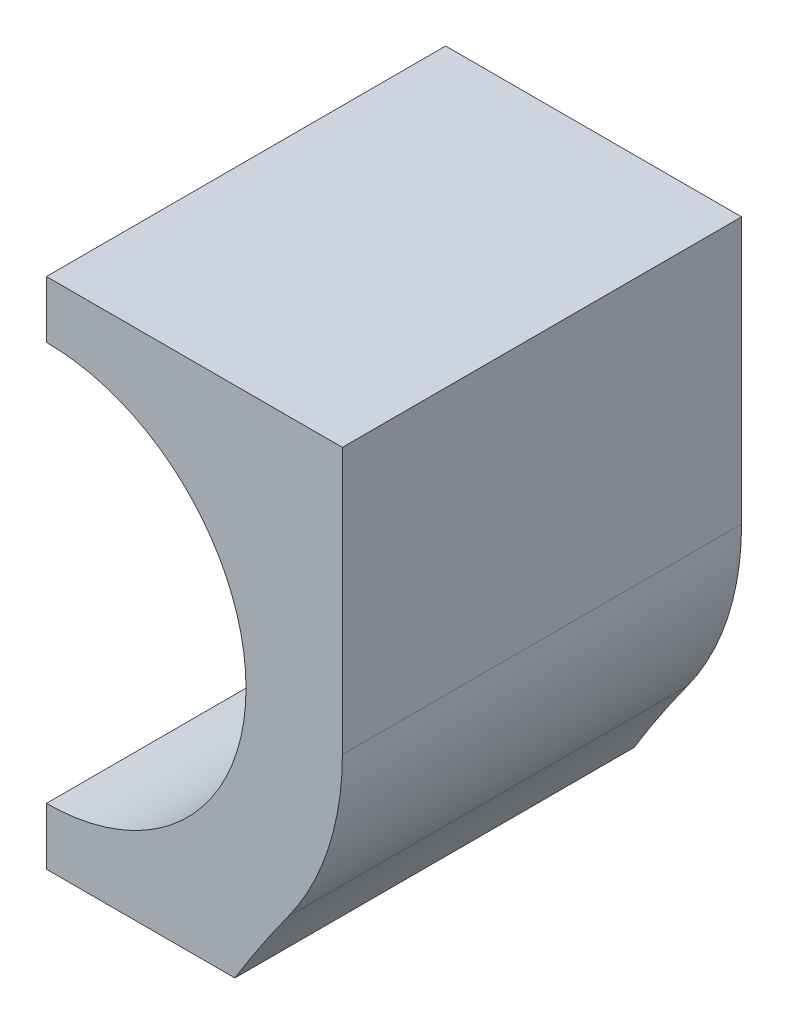
ISO-10303-21;
HEADER;
FILE_DESCRIPTION(('STEP AP214'),'2;1');
FILE_NAME('part.step','',(''),(''),'','','');
FILE_SCHEMA(('AUTOMOTIVE_DESIGN { 1 0 10303 214 1 1 1 1 }'));
ENDSEC;
DATA;
#1=APPLICATION_CONTEXT('core data for automotive mechanical design processes');
#2=APPLICATION_PROTOCOL_DEFINITION('international standard','automotive_design',2000,#1);
#3=PRODUCT_CONTEXT('',#1,'mechanical');
#4=PRODUCT('Part','Part','',(#3));
#5=PRODUCT_RELATED_PRODUCT_CATEGORY('part','',(#4));
#6=PRODUCT_DEFINITION_FORMATION('','',#4);
#7=PRODUCT_DEFINITION_CONTEXT('part definition',#1,'design');
#8=PRODUCT_DEFINITION('design','',#6,#7);
#9=PRODUCT_DEFINITION_SHAPE('','',#8);
#10=(LENGTH_UNIT() NAMED_UNIT(*) SI_UNIT(.MILLI.,.METRE.));
#11=(NAMED_UNIT(*) PLANE_ANGLE_UNIT() SI_UNIT($,.RADIAN.));
#12=(NAMED_UNIT(*) SI_UNIT($,.STERADIAN.) SOLID_ANGLE_UNIT());
#13=UNCERTAINTY_MEASURE_WITH_UNIT(LENGTH_MEASURE(1.E-05),#10,'distance_accuracy_value','');
#14=(GEOMETRIC_REPRESENTATION_CONTEXT(3) GLOBAL_UNCERTAINTY_ASSIGNED_CONTEXT((#13)) GLOBAL_UNIT_ASSIGNED_CONTEXT((#10,
#11,#12)) REPRESENTATION_CONTEXT('',''));
#15=CARTESIAN_POINT('',(0.,0.,0.));
#16=DIRECTION('',(0.,0.,1.));
#17=DIRECTION('',(1.,0.,0.));
#18=AXIS2_PLACEMENT_3D('',#15,#16,#17);
#19=CARTESIAN_POINT('',(-14.3350507415989,439.94620922742,34.7774113637381));
#20=DIRECTION('',(0.,0.,-1.));
#21=DIRECTION('',(-1.,0.,0.));
#22=AXIS2_PLACEMENT_3D('',#19,#20,#21);
#23=CYLINDRICAL_SURFACE('',#22,9.99999999999998);
#24=CARTESIAN_POINT('',(-14.3350507415989,439.94620922742,14.0000000000005));
#25=DIRECTION('',(0.,0.,1.));
#26=DIRECTION('',(0.,-1.,0.));
#27=AXIS2_PLACEMENT_3D('',#24,#25,#26);
#28=CIRCLE('',#27,9.99999999999998);
#29=CARTESIAN_POINT('',(-6.23981264636083,434.075338748402,14.0000000000004));
#30=VERTEX_POINT('',#29);
#31=CARTESIAN_POINT('',(-4.33505074159894,439.94620922742,14.0000000000006));
#32=VERTEX_POINT('',#31);
#33=EDGE_CURVE('E132',#30,#32,#28,.T.);
#34=ORIENTED_EDGE('',*,*,#33,.F.);
#35=DIRECTION('',(0.,0.,-1.));
#36=VECTOR('',#35,1.);
#37=CARTESIAN_POINT('',(-6.23981264636084,434.075338748402,34.7774113637381));
#38=LINE('',#37,#36);
#39=CARTESIAN_POINT('',(-6.23981264636084,434.075338748402,0.));
#40=VERTEX_POINT('',#39);
#41=EDGE_CURVE('E37',#30,#40,#38,.T.);
#42=ORIENTED_EDGE('',*,*,#41,.T.);
#43=CARTESIAN_POINT('',(-14.3350507415989,439.94620922742,0.));
#44=DIRECTION('',(0.,0.,1.));
#45=DIRECTION('',(1.,0.,0.));
#46=AXIS2_PLACEMENT_3D('',#43,#44,#45);
#47=CIRCLE('',#46,9.99999999999998);
#48=CARTESIAN_POINT('',(-4.33505074159894,439.94620922742,0.));
#49=VERTEX_POINT('',#48);
#50=EDGE_CURVE('E140',#40,#49,#47,.T.);
#51=ORIENTED_EDGE('',*,*,#50,.T.);
#52=DIRECTION('',(0.,0.,-1.));
#53=VECTOR('',#52,1.);
#54=CARTESIAN_POINT('',(-4.33505074159894,439.94620922742,34.7774113637381));
#55=LINE('',#54,#53);
#56=EDGE_CURVE('E88',#32,#49,#55,.T.);
#57=ORIENTED_EDGE('',*,*,#56,.F.);
#58=EDGE_LOOP('',(#34,#42,#51,#57));
#59=FACE_BOUND('',#58,.T.);
#60=ADVANCED_FACE('F33',(#59),#23,.T.);
#61=CARTESIAN_POINT('',(-4.33505074159894,439.94620922742,34.7774113637381));
#62=DIRECTION('',(-1.,0.,0.));
#63=DIRECTION('',(0.,0.,1.));
#64=AXIS2_PLACEMENT_3D('',#61,#62,#63);
#65=PLANE('',#64);
#66=DIRECTION('',(0.,1.,0.));
#67=VECTOR('',#66,1.);
#68=CARTESIAN_POINT('',(-4.33505074159894,439.94620922742,14.0000000000005));
#69=LINE('',#68,#67);
#70=CARTESIAN_POINT('',(-4.33505074159894,449.276757584087,14.0000000000006));
#71=VERTEX_POINT('',#70);
#72=EDGE_CURVE('E95',#32,#71,#69,.T.);
#73=ORIENTED_EDGE('',*,*,#72,.F.);
#74=ORIENTED_EDGE('',*,*,#56,.T.);
#75=DIRECTION('',(0.,1.,0.));
#76=VECTOR('',#75,1.);
#77=CARTESIAN_POINT('',(-4.33505074159894,439.94620922742,0.));
#78=LINE('',#77,#76);
#79=CARTESIAN_POINT('',(-4.33505074159894,449.276757584087,0.));
#80=VERTEX_POINT('',#79);
#81=EDGE_CURVE('E139',#49,#80,#78,.T.);
#82=ORIENTED_EDGE('',*,*,#81,.T.);
#83=DIRECTION('',(0.,0.,-1.));
#84=VECTOR('',#83,1.);
#85=CARTESIAN_POINT('',(-4.33505074159894,449.276757584087,34.7774113637381));
#86=LINE('',#85,#84);
#87=EDGE_CURVE('E141',#71,#80,#86,.T.);
#88=ORIENTED_EDGE('',*,*,#87,.F.);
#89=EDGE_LOOP('',(#73,#74,#82,#88));
#90=FACE_BOUND('',#89,.T.);
#91=ADVANCED_FACE('F170',(#90),#65,.F.);
#92=CARTESIAN_POINT('',(-14.7129514434736,449.276757584087,34.7774113637381));
#93=DIRECTION('',(0.,-1.,0.));
#94=DIRECTION('',(0.,0.,-1.));
#95=AXIS2_PLACEMENT_3D('',#92,#93,#94);
#96=PLANE('',#95);
#97=DIRECTION('',(-1.,0.,0.));
#98=VECTOR('',#97,1.);
#99=CARTESIAN_POINT('',(-14.7129514434736,449.276757584087,14.0000000000006));
#100=LINE('',#99,#98);
#101=CARTESIAN_POINT('',(-14.7129514434736,449.276757584087,14.0000000000006));
#102=VERTEX_POINT('',#101);
#103=EDGE_CURVE('E128',#71,#102,#100,.T.);
#104=ORIENTED_EDGE('',*,*,#103,.F.);
#105=ORIENTED_EDGE('',*,*,#87,.T.);
#106=DIRECTION('',(-1.,0.,0.));
#107=VECTOR('',#106,1.);
#108=CARTESIAN_POINT('',(-14.7129514434736,449.276757584087,0.));
#109=LINE('',#108,#107);
#110=CARTESIAN_POINT('',(-14.7129514434736,449.276757584087,0.));
#111=VERTEX_POINT('',#110);
#112=EDGE_CURVE('E143',#80,#111,#109,.T.);
#113=ORIENTED_EDGE('',*,*,#112,.T.);
#114=DIRECTION('',(0.,0.,-1.));
#115=VECTOR('',#114,1.);
#116=CARTESIAN_POINT('',(-14.7129514434736,449.276757584087,34.7774113637381));
#117=LINE('',#116,#115);
#118=EDGE_CURVE('E144',#102,#111,#117,.T.);
#119=ORIENTED_EDGE('',*,*,#118,.F.);
#120=EDGE_LOOP('',(#104,#105,#113,#119));
#121=FACE_BOUND('',#120,.T.);
#122=ADVANCED_FACE('F173',(#121),#96,.F.);
#123=CARTESIAN_POINT('',(-14.7129514434736,447.276757584087,34.7774113637381));
#124=DIRECTION('',(1.,0.,0.));
#125=DIRECTION('',(0.,0.,-1.));
#126=AXIS2_PLACEMENT_3D('',#123,#124,#125);
#127=PLANE('',#126);
#128=DIRECTION('',(0.,-1.,0.));
#129=VECTOR('',#128,1.);
#130=CARTESIAN_POINT('',(-14.7129514434736,447.276757584087,14.0000000000006));
#131=LINE('',#130,#129);
#132=CARTESIAN_POINT('',(-14.7129514434736,447.276757584087,14.0000000000004));
#133=VERTEX_POINT('',#132);
#134=EDGE_CURVE('E123',#102,#133,#131,.T.);
#135=ORIENTED_EDGE('',*,*,#134,.F.);
#136=ORIENTED_EDGE('',*,*,#118,.T.);
#137=DIRECTION('',(0.,-1.,0.));
#138=VECTOR('',#137,1.);
#139=CARTESIAN_POINT('',(-14.7129514434736,447.276757584087,0.));
#140=LINE('',#139,#138);
#141=CARTESIAN_POINT('',(-14.7129514434736,447.276757584087,0.));
#142=VERTEX_POINT('',#141);
#143=EDGE_CURVE('E146',#111,#142,#140,.T.);
#144=ORIENTED_EDGE('',*,*,#143,.T.);
#145=DIRECTION('',(0.,0.,-1.));
#146=VECTOR('',#145,1.);
#147=CARTESIAN_POINT('',(-14.7129514434736,447.276757584087,34.7774113637381));
#148=LINE('',#147,#146);
#149=EDGE_CURVE('E147',#133,#142,#148,.T.);
#150=ORIENTED_EDGE('',*,*,#149,.F.);
#151=EDGE_LOOP('',(#135,#136,#144,#150));
#152=FACE_BOUND('',#151,.T.);
#153=ADVANCED_FACE('F175',(#152),#127,.F.);
#154=CARTESIAN_POINT('',(-14.7129514434736,440.276757584087,34.7774113637381));
#155=DIRECTION('',(0.,0.,-1.));
#156=DIRECTION('',(-1.,0.,0.));
#157=AXIS2_PLACEMENT_3D('',#154,#155,#156);
#158=CYLINDRICAL_SURFACE('',#157,7.00000000000001);
#159=CARTESIAN_POINT('',(-14.7129514434736,440.276757584087,14.0000000000005));
#160=DIRECTION('',(0.,0.,1.));
#161=DIRECTION('',(0.,-1.,0.));
#162=AXIS2_PLACEMENT_3D('',#159,#160,#161);
#163=CIRCLE('',#162,7.00000000000001);
#164=CARTESIAN_POINT('',(-14.7129514434736,433.276757584087,14.0000000000004));
#165=VERTEX_POINT('',#164);
#166=EDGE_CURVE('E121',#133,#165,#163,.F.);
#167=ORIENTED_EDGE('',*,*,#166,.F.);
#168=ORIENTED_EDGE('',*,*,#149,.T.);
#169=CARTESIAN_POINT('',(-14.7129514434736,440.276757584087,0.));
#170=DIRECTION('',(0.,0.,-1.));
#171=DIRECTION('',(1.,0.,0.));
#172=AXIS2_PLACEMENT_3D('',#169,#170,#171);
#173=CIRCLE('',#172,7.00000000000001);
#174=CARTESIAN_POINT('',(-14.7129514434736,433.276757584087,0.));
#175=VERTEX_POINT('',#174);
#176=EDGE_CURVE('E149',#142,#175,#173,.T.);
#177=ORIENTED_EDGE('',*,*,#176,.T.);
#178=DIRECTION('',(0.,0.,-1.));
#179=VECTOR('',#178,1.);
#180=CARTESIAN_POINT('',(-14.7129514434736,433.276757584087,34.7774113637381));
#181=LINE('',#180,#179);
#182=EDGE_CURVE('E150',#165,#175,#181,.T.);
#183=ORIENTED_EDGE('',*,*,#182,.F.);
#184=EDGE_LOOP('',(#167,#168,#177,#183));
#185=FACE_BOUND('',#184,.T.);
#186=ADVANCED_FACE('F179',(#185),#158,.F.);
#187=CARTESIAN_POINT('',(-14.7129514434736,433.276757584087,34.7774113637381));
#188=DIRECTION('',(1.,0.,0.));
#189=DIRECTION('',(0.,0.,-1.));
#190=AXIS2_PLACEMENT_3D('',#187,#188,#189);
#191=PLANE('',#190);
#192=DIRECTION('',(0.,-1.,0.));
#193=VECTOR('',#192,1.);
#194=CARTESIAN_POINT('',(-14.7129514434736,433.276757584087,14.0000000000004));
#195=LINE('',#194,#193);
#196=CARTESIAN_POINT('',(-14.7129514434736,431.276757584087,14.0000000000004));
#197=VERTEX_POINT('',#196);
#198=EDGE_CURVE('E42',#165,#197,#195,.T.);
#199=ORIENTED_EDGE('',*,*,#198,.F.);
#200=ORIENTED_EDGE('',*,*,#182,.T.);
#201=DIRECTION('',(0.,-1.,0.));
#202=VECTOR('',#201,1.);
#203=CARTESIAN_POINT('',(-14.7129514434736,433.276757584087,0.));
#204=LINE('',#203,#202);
#205=CARTESIAN_POINT('',(-14.7129514434736,431.276757584087,0.));
#206=VERTEX_POINT('',#205);
#207=EDGE_CURVE('E115',#175,#206,#204,.T.);
#208=ORIENTED_EDGE('',*,*,#207,.T.);
#209=DIRECTION('',(0.,0.,-1.));
#210=VECTOR('',#209,1.);
#211=CARTESIAN_POINT('',(-14.7129514434736,431.276757584087,34.7774113637381));
#212=LINE('',#211,#210);
#213=EDGE_CURVE('E106',#197,#206,#212,.T.);
#214=ORIENTED_EDGE('',*,*,#213,.F.);
#215=EDGE_LOOP('',(#199,#200,#208,#214));
#216=FACE_BOUND('',#215,.T.);
#217=ADVANCED_FACE('F112',(#216),#191,.F.);
#218=CARTESIAN_POINT('',(-14.7129514434736,431.276757584087,34.7774113637381));
#219=DIRECTION('',(0.,1.,0.));
#220=DIRECTION('',(0.,0.,1.));
#221=AXIS2_PLACEMENT_3D('',#218,#219,#220);
#222=PLANE('',#221);
#223=DIRECTION('',(1.,0.,0.));
#224=VECTOR('',#223,1.);
#225=CARTESIAN_POINT('',(-14.7129514434736,431.276757584087,14.0000000000004));
#226=LINE('',#225,#224);
#227=CARTESIAN_POINT('',(-8.10503143205672,431.276757584087,13.9999999999997));
#228=VERTEX_POINT('',#227);
#229=EDGE_CURVE('E11',#197,#228,#226,.T.);
#230=ORIENTED_EDGE('',*,*,#229,.F.);
#231=ORIENTED_EDGE('',*,*,#213,.T.);
#232=DIRECTION('',(1.,0.,0.));
#233=VECTOR('',#232,1.);
#234=CARTESIAN_POINT('',(-14.7129514434736,431.276757584087,0.));
#235=LINE('',#234,#233);
#236=CARTESIAN_POINT('',(-8.10503143205672,431.276757584087,0.));
#237=VERTEX_POINT('',#236);
#238=EDGE_CURVE('E117',#206,#237,#235,.T.);
#239=ORIENTED_EDGE('',*,*,#238,.T.);
#240=DIRECTION('',(0.,0.,-1.));
#241=VECTOR('',#240,1.);
#242=CARTESIAN_POINT('',(-8.10503143205672,431.276757584087,34.7774113637381));
#243=LINE('',#242,#241);
#244=EDGE_CURVE('E55',#228,#237,#243,.T.);
#245=ORIENTED_EDGE('',*,*,#244,.F.);
#246=EDGE_LOOP('',(#230,#231,#239,#245));
#247=FACE_BOUND('',#246,.T.);
#248=ADVANCED_FACE('F105',(#247),#222,.F.);
#249=CARTESIAN_POINT('',(28.1649492584011,409.124139212575,34.7774113637381));
#250=DIRECTION('',(0.,0.,-1.));
#251=DIRECTION('',(-1.,0.,0.));
#252=AXIS2_PLACEMENT_3D('',#249,#250,#251);
#253=CYLINDRICAL_SURFACE('',#252,42.5);
#254=CARTESIAN_POINT('',(28.1649492584011,409.124139212575,14.0000000000001));
#255=DIRECTION('',(0.,0.,1.));
#256=DIRECTION('',(0.,-1.,0.));
#257=AXIS2_PLACEMENT_3D('',#254,#255,#256);
#258=CIRCLE('',#257,42.5);
#259=EDGE_CURVE('E135',#228,#30,#258,.F.);
#260=ORIENTED_EDGE('',*,*,#259,.F.);
#261=ORIENTED_EDGE('',*,*,#244,.T.);
#262=CARTESIAN_POINT('',(28.1649492584011,409.124139212575,0.));
#263=DIRECTION('',(0.,0.,-1.));
#264=DIRECTION('',(1.,0.,0.));
#265=AXIS2_PLACEMENT_3D('',#262,#263,#264);
#266=CIRCLE('',#265,42.5);
#267=EDGE_CURVE('E137',#237,#40,#266,.T.);
#268=ORIENTED_EDGE('',*,*,#267,.T.);
#269=ORIENTED_EDGE('',*,*,#41,.F.);
#270=EDGE_LOOP('',(#260,#261,#268,#269));
#271=FACE_BOUND('',#270,.T.);
#272=ADVANCED_FACE('F165',(#271),#253,.F.);
#273=CARTESIAN_POINT('',(-14.3350507415989,439.94620922742,0.));
#274=DIRECTION('',(0.,0.,1.));
#275=DIRECTION('',(1.,0.,0.));
#276=AXIS2_PLACEMENT_3D('',#273,#274,#275);
#277=PLANE('',#276);
#278=ORIENTED_EDGE('',*,*,#50,.F.);
#279=ORIENTED_EDGE('',*,*,#267,.F.);
#280=ORIENTED_EDGE('',*,*,#238,.F.);
#281=ORIENTED_EDGE('',*,*,#207,.F.);
#282=ORIENTED_EDGE('',*,*,#176,.F.);
#283=ORIENTED_EDGE('',*,*,#143,.F.);
#284=ORIENTED_EDGE('',*,*,#112,.F.);
#285=ORIENTED_EDGE('',*,*,#81,.F.);
#286=EDGE_LOOP('',(#278,#279,#280,#281,#282,#283,#284,#285));
#287=FACE_BOUND('',#286,.T.);
#288=ADVANCED_FACE('F167',(#287),#277,.F.);
#289=CARTESIAN_POINT('',(28.1649492584011,409.124139212575,14.0000000000001));
#290=DIRECTION('',(0.,0.,1.));
#291=DIRECTION('',(-1.,0.,0.));
#292=AXIS2_PLACEMENT_3D('',#289,#290,#291);
#293=PLANE('',#292);
#294=ORIENTED_EDGE('',*,*,#259,.T.);
#295=ORIENTED_EDGE('',*,*,#33,.T.);
#296=ORIENTED_EDGE('',*,*,#72,.T.);
#297=ORIENTED_EDGE('',*,*,#103,.T.);
#298=ORIENTED_EDGE('',*,*,#134,.T.);
#299=ORIENTED_EDGE('',*,*,#166,.T.);
#300=ORIENTED_EDGE('',*,*,#198,.T.);
#301=ORIENTED_EDGE('',*,*,#229,.T.);
#302=EDGE_LOOP('',(#294,#295,#296,#297,#298,#299,#300,#301));
#303=FACE_BOUND('',#302,.T.);
#304=ADVANCED_FACE('F35',(#303),#293,.T.);
#305=CLOSED_SHELL('',(#60,#91,#122,#153,#186,#217,#248,#272,#288,#304));
#306=MANIFOLD_SOLID_BREP('B2',#305);
#307=ADVANCED_BREP_SHAPE_REPRESENTATION('',(#18,#306),#14);
#308=SHAPE_DEFINITION_REPRESENTATION(#9,#307);
ENDSEC;
END-ISO-10303-21;
